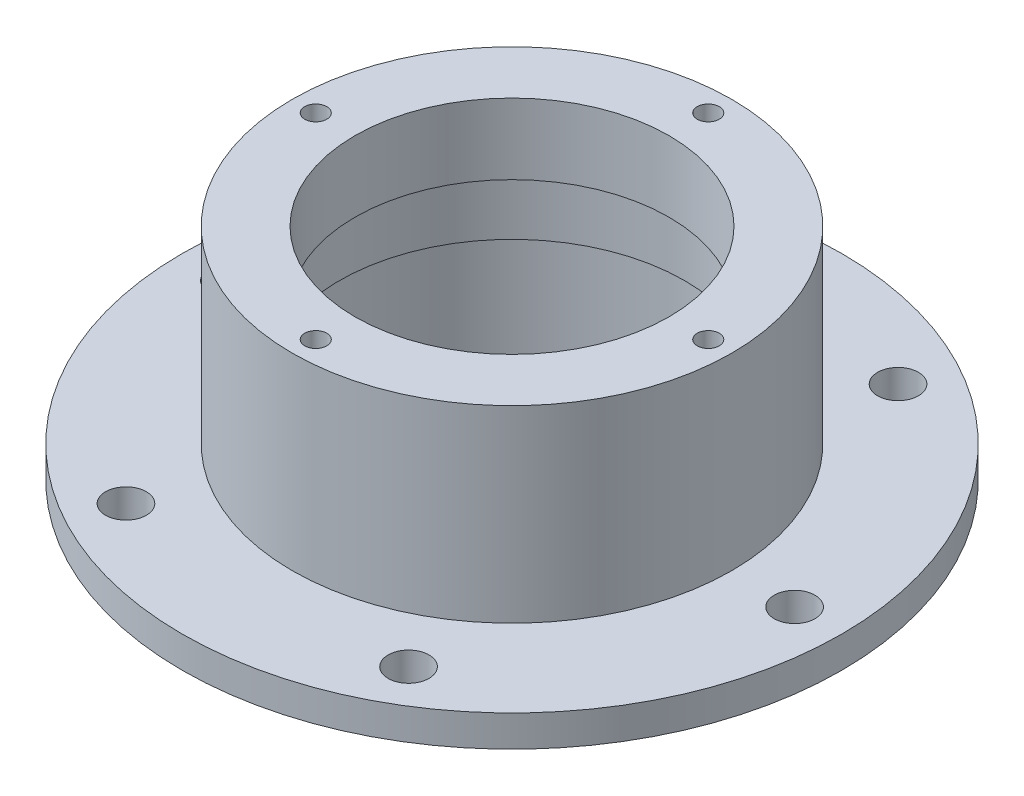
ISO-10303-21;
HEADER;
FILE_DESCRIPTION(('STEP AP214'),'2;1');
FILE_NAME('part.step','',(''),(''),'','','');
FILE_SCHEMA(('AUTOMOTIVE_DESIGN { 1 0 10303 214 1 1 1 1 }'));
ENDSEC;
DATA;
#1=APPLICATION_CONTEXT('core data for automotive mechanical design processes');
#2=APPLICATION_PROTOCOL_DEFINITION('international standard','automotive_design',2000,#1);
#3=PRODUCT_CONTEXT('',#1,'mechanical');
#4=PRODUCT('Part','Part','',(#3));
#5=PRODUCT_RELATED_PRODUCT_CATEGORY('part','',(#4));
#6=PRODUCT_DEFINITION_FORMATION('','',#4);
#7=PRODUCT_DEFINITION_CONTEXT('part definition',#1,'design');
#8=PRODUCT_DEFINITION('design','',#6,#7);
#9=PRODUCT_DEFINITION_SHAPE('','',#8);
#10=(LENGTH_UNIT() NAMED_UNIT(*) SI_UNIT(.MILLI.,.METRE.));
#11=(NAMED_UNIT(*) PLANE_ANGLE_UNIT() SI_UNIT($,.RADIAN.));
#12=(NAMED_UNIT(*) SI_UNIT($,.STERADIAN.) SOLID_ANGLE_UNIT());
#13=UNCERTAINTY_MEASURE_WITH_UNIT(LENGTH_MEASURE(1.E-05),#10,'distance_accuracy_value','');
#14=(GEOMETRIC_REPRESENTATION_CONTEXT(3) GLOBAL_UNCERTAINTY_ASSIGNED_CONTEXT((#13)) GLOBAL_UNIT_ASSIGNED_CONTEXT((#10,
#11,#12)) REPRESENTATION_CONTEXT('',''));
#15=CARTESIAN_POINT('',(0.,0.,0.));
#16=DIRECTION('',(0.,0.,1.));
#17=DIRECTION('',(1.,0.,0.));
#18=AXIS2_PLACEMENT_3D('',#15,#16,#17);
#19=CARTESIAN_POINT('',(0.,4.99999999999999,0.));
#20=DIRECTION('',(0.,-1.,0.));
#21=DIRECTION('',(0.,0.,-1.));
#22=AXIS2_PLACEMENT_3D('',#19,#20,#21);
#23=CYLINDRICAL_SURFACE('',#22,65.);
#24=DIRECTION('',(0.,1.,0.));
#25=VECTOR('',#24,1.);
#26=CARTESIAN_POINT('',(2.49753798769898,37.5,-64.9520000000001));
#27=LINE('',#26,#25);
#28=CARTESIAN_POINT('',(2.49753798769889,4.99999999999999,-64.952));
#29=VERTEX_POINT('',#28);
#30=CARTESIAN_POINT('',(2.49753798769889,0.,-64.952));
#31=VERTEX_POINT('',#30);
#32=EDGE_CURVE('E55',#29,#31,#27,.F.);
#33=ORIENTED_EDGE('',*,*,#32,.F.);
#34=CARTESIAN_POINT('',(0.,4.99999999999999,0.));
#35=DIRECTION('',(0.,-1.,0.));
#36=DIRECTION('',(0.,0.,-1.));
#37=AXIS2_PLACEMENT_3D('',#34,#35,#36);
#38=CIRCLE('',#37,65.);
#39=CARTESIAN_POINT('',(64.952,4.99999999999999,-2.49753798769897));
#40=VERTEX_POINT('',#39);
#41=EDGE_CURVE('E152',#29,#40,#38,.T.);
#42=ORIENTED_EDGE('',*,*,#41,.T.);
#43=DIRECTION('',(0.,1.,0.));
#44=VECTOR('',#43,1.);
#45=CARTESIAN_POINT('',(64.9520000000001,37.5,-2.49753798769897));
#46=LINE('',#45,#44);
#47=CARTESIAN_POINT('',(64.952,0.,-2.49753798769897));
#48=VERTEX_POINT('',#47);
#49=EDGE_CURVE('E330',#48,#40,#46,.T.);
#50=ORIENTED_EDGE('',*,*,#49,.F.);
#51=CARTESIAN_POINT('',(0.,0.,0.));
#52=DIRECTION('',(0.,-1.,0.));
#53=DIRECTION('',(0.,0.,-1.));
#54=AXIS2_PLACEMENT_3D('',#51,#52,#53);
#55=CIRCLE('',#54,65.);
#56=EDGE_CURVE('E62',#31,#48,#55,.T.);
#57=ORIENTED_EDGE('',*,*,#56,.F.);
#58=EDGE_LOOP('',(#33,#42,#50,#57));
#59=FACE_BOUND('',#58,.T.);
#60=ADVANCED_FACE('F39',(#59),#23,.T.);
#61=DIRECTION('',(0.,1.,0.));
#62=VECTOR('',#61,1.);
#63=CARTESIAN_POINT('',(64.9520000000001,37.5,2.49753798769897));
#64=LINE('',#63,#62);
#65=CARTESIAN_POINT('',(64.952,4.99999999999999,2.49753798769889));
#66=VERTEX_POINT('',#65);
#67=CARTESIAN_POINT('',(64.9520000000001,0.,2.49753798769897));
#68=VERTEX_POINT('',#67);
#69=EDGE_CURVE('E167',#66,#68,#64,.F.);
#70=ORIENTED_EDGE('',*,*,#69,.F.);
#71=CARTESIAN_POINT('',(2.49753798769896,4.99999999999999,64.952));
#72=VERTEX_POINT('',#71);
#73=EDGE_CURVE('E132',#66,#72,#38,.T.);
#74=ORIENTED_EDGE('',*,*,#73,.T.);
#75=DIRECTION('',(0.,1.,0.));
#76=VECTOR('',#75,1.);
#77=CARTESIAN_POINT('',(2.49753798769898,37.5,64.9520000000001));
#78=LINE('',#77,#76);
#79=CARTESIAN_POINT('',(2.49753798769896,0.,64.952));
#80=VERTEX_POINT('',#79);
#81=EDGE_CURVE('E166',#80,#72,#78,.T.);
#82=ORIENTED_EDGE('',*,*,#81,.F.);
#83=EDGE_CURVE('E134',#68,#80,#55,.T.);
#84=ORIENTED_EDGE('',*,*,#83,.F.);
#85=EDGE_LOOP('',(#70,#74,#82,#84));
#86=FACE_BOUND('',#85,.T.);
#87=ADVANCED_FACE('F164',(#86),#23,.T.);
#88=DIRECTION('',(0.,1.,0.));
#89=VECTOR('',#88,1.);
#90=CARTESIAN_POINT('',(-2.49753798769898,37.5,64.9520000000001));
#91=LINE('',#90,#89);
#92=CARTESIAN_POINT('',(-2.49753798769889,4.99999999999999,64.952));
#93=VERTEX_POINT('',#92);
#94=CARTESIAN_POINT('',(-2.49753798769897,0.,64.9520000000001));
#95=VERTEX_POINT('',#94);
#96=EDGE_CURVE('E185',#93,#95,#91,.F.);
#97=ORIENTED_EDGE('',*,*,#96,.F.);
#98=CARTESIAN_POINT('',(-64.952,4.99999999999999,2.49753798769899));
#99=VERTEX_POINT('',#98);
#100=EDGE_CURVE('E128',#93,#99,#38,.T.);
#101=ORIENTED_EDGE('',*,*,#100,.T.);
#102=DIRECTION('',(0.,1.,0.));
#103=VECTOR('',#102,1.);
#104=CARTESIAN_POINT('',(-64.9520000000001,37.5,2.49753798769898));
#105=LINE('',#104,#103);
#106=CARTESIAN_POINT('',(-64.9520000000001,0.,2.49753798769897));
#107=VERTEX_POINT('',#106);
#108=EDGE_CURVE('E197',#107,#99,#105,.T.);
#109=ORIENTED_EDGE('',*,*,#108,.F.);
#110=EDGE_CURVE('E129',#95,#107,#55,.T.);
#111=ORIENTED_EDGE('',*,*,#110,.F.);
#112=EDGE_LOOP('',(#97,#101,#109,#111));
#113=FACE_BOUND('',#112,.T.);
#114=ADVANCED_FACE('F304',(#113),#23,.T.);
#115=CARTESIAN_POINT('',(0.,75.,0.));
#116=DIRECTION('',(0.,-1.,0.));
#117=DIRECTION('',(0.,0.,-1.));
#118=AXIS2_PLACEMENT_3D('',#115,#116,#117);
#119=CYLINDRICAL_SURFACE('',#118,105.);
#120=CARTESIAN_POINT('',(0.,15.,0.));
#121=DIRECTION('',(0.,-1.,0.));
#122=DIRECTION('',(0.,0.,-1.));
#123=AXIS2_PLACEMENT_3D('',#120,#121,#122);
#124=CIRCLE('',#123,105.);
#125=CARTESIAN_POINT('',(0.,15.,-105.));
#126=VERTEX_POINT('',#125);
#127=EDGE_CURVE('E142',#126,#126,#124,.T.);
#128=ORIENTED_EDGE('',*,*,#127,.T.);
#129=EDGE_LOOP('',(#128));
#130=FACE_BOUND('',#129,.T.);
#131=CARTESIAN_POINT('',(0.,4.99999999999999,0.));
#132=DIRECTION('',(0.,-1.,0.));
#133=DIRECTION('',(0.,0.,-1.));
#134=AXIS2_PLACEMENT_3D('',#131,#132,#133);
#135=CIRCLE('',#134,105.);
#136=CARTESIAN_POINT('',(0.,4.99999999999999,-105.));
#137=VERTEX_POINT('',#136);
#138=EDGE_CURVE('E11',#137,#137,#135,.T.);
#139=ORIENTED_EDGE('',*,*,#138,.F.);
#140=EDGE_LOOP('',(#139));
#141=FACE_BOUND('',#140,.T.);
#142=ADVANCED_FACE('F41',(#130,#141),#119,.T.);
#143=CARTESIAN_POINT('',(0.,4.99999999999999,0.));
#144=DIRECTION('',(0.,-1.,0.));
#145=DIRECTION('',(0.,0.,-1.));
#146=AXIS2_PLACEMENT_3D('',#143,#144,#145);
#147=PLANE('',#146);
#148=CARTESIAN_POINT('',(0.,4.99999999999999,-62.5));
#149=DIRECTION('',(0.,-1.,0.));
#150=DIRECTION('',(0.,0.,-1.));
#151=AXIS2_PLACEMENT_3D('',#148,#149,#150);
#152=CIRCLE('',#151,3.49999999999999);
#153=CARTESIAN_POINT('',(-2.497537987699,4.99999999999999,-64.952));
#154=VERTEX_POINT('',#153);
#155=EDGE_CURVE('E121',#154,#29,#152,.T.);
#156=ORIENTED_EDGE('',*,*,#155,.F.);
#157=CARTESIAN_POINT('',(-64.952,4.99999999999999,-2.49753798769889));
#158=VERTEX_POINT('',#157);
#159=EDGE_CURVE('E48',#158,#154,#38,.T.);
#160=ORIENTED_EDGE('',*,*,#159,.F.);
#161=CARTESIAN_POINT('',(-62.5,4.99999999999999,0.));
#162=DIRECTION('',(0.,-1.,0.));
#163=DIRECTION('',(0.,0.,-1.));
#164=AXIS2_PLACEMENT_3D('',#161,#162,#163);
#165=CIRCLE('',#164,3.49999999999999);
#166=EDGE_CURVE('E201',#99,#158,#165,.T.);
#167=ORIENTED_EDGE('',*,*,#166,.F.);
#168=ORIENTED_EDGE('',*,*,#100,.F.);
#169=CARTESIAN_POINT('',(0.,4.99999999999999,62.5));
#170=DIRECTION('',(0.,-1.,0.));
#171=DIRECTION('',(0.,0.,-1.));
#172=AXIS2_PLACEMENT_3D('',#169,#170,#171);
#173=CIRCLE('',#172,3.49999999999999);
#174=EDGE_CURVE('E175',#72,#93,#173,.T.);
#175=ORIENTED_EDGE('',*,*,#174,.F.);
#176=ORIENTED_EDGE('',*,*,#73,.F.);
#177=CARTESIAN_POINT('',(62.5,4.99999999999999,0.));
#178=DIRECTION('',(0.,-1.,0.));
#179=DIRECTION('',(0.,0.,-1.));
#180=AXIS2_PLACEMENT_3D('',#177,#178,#179);
#181=CIRCLE('',#180,3.49999999999998);
#182=EDGE_CURVE('E327',#40,#66,#181,.T.);
#183=ORIENTED_EDGE('',*,*,#182,.F.);
#184=ORIENTED_EDGE('',*,*,#41,.F.);
#185=EDGE_LOOP('',(#156,#160,#167,#168,#175,#176,#183,#184));
#186=FACE_BOUND('',#185,.T.);
#187=CARTESIAN_POINT('',(90.,4.99999999999999,0.));
#188=DIRECTION('',(0.,-1.,0.));
#189=DIRECTION('',(0.,0.,-1.));
#190=AXIS2_PLACEMENT_3D('',#187,#188,#189);
#191=CIRCLE('',#190,6.49999999999999);
#192=CARTESIAN_POINT('',(90.,4.99999999999999,-6.49999999999999));
#193=VERTEX_POINT('',#192);
#194=EDGE_CURVE('E211',#193,#193,#191,.T.);
#195=ORIENTED_EDGE('',*,*,#194,.F.);
#196=EDGE_LOOP('',(#195));
#197=FACE_BOUND('',#196,.T.);
#198=CARTESIAN_POINT('',(44.9999999999998,4.99999999999999,77.9422863405996));
#199=DIRECTION('',(0.,-1.,0.));
#200=DIRECTION('',(0.,0.,-1.));
#201=AXIS2_PLACEMENT_3D('',#198,#199,#200);
#202=CIRCLE('',#201,6.5);
#203=CARTESIAN_POINT('',(44.9999999999998,4.99999999999999,71.4422863405996));
#204=VERTEX_POINT('',#203);
#205=EDGE_CURVE('E219',#204,#204,#202,.T.);
#206=ORIENTED_EDGE('',*,*,#205,.F.);
#207=EDGE_LOOP('',(#206));
#208=FACE_BOUND('',#207,.T.);
#209=CARTESIAN_POINT('',(-45.0000000000004,4.99999999999999,77.9422863405993));
#210=DIRECTION('',(0.,-1.,0.));
#211=DIRECTION('',(0.,0.,-1.));
#212=AXIS2_PLACEMENT_3D('',#209,#210,#211);
#213=CIRCLE('',#212,6.5);
#214=CARTESIAN_POINT('',(-45.0000000000004,4.99999999999999,71.4422863405993));
#215=VERTEX_POINT('',#214);
#216=EDGE_CURVE('E227',#215,#215,#213,.T.);
#217=ORIENTED_EDGE('',*,*,#216,.F.);
#218=EDGE_LOOP('',(#217));
#219=FACE_BOUND('',#218,.T.);
#220=CARTESIAN_POINT('',(-90.,4.99999999999999,-6.28466640991764E-13));
#221=DIRECTION('',(0.,-1.,0.));
#222=DIRECTION('',(0.,0.,-1.));
#223=AXIS2_PLACEMENT_3D('',#220,#221,#222);
#224=CIRCLE('',#223,6.49999999999999);
#225=CARTESIAN_POINT('',(-90.,4.99999999999999,-6.50000000000062));
#226=VERTEX_POINT('',#225);
#227=EDGE_CURVE('E235',#226,#226,#224,.T.);
#228=ORIENTED_EDGE('',*,*,#227,.F.);
#229=EDGE_LOOP('',(#228));
#230=FACE_BOUND('',#229,.T.);
#231=CARTESIAN_POINT('',(-44.9999999999993,4.99999999999999,-77.9422863405999));
#232=DIRECTION('',(0.,-1.,0.));
#233=DIRECTION('',(0.,0.,-1.));
#234=AXIS2_PLACEMENT_3D('',#231,#232,#233);
#235=CIRCLE('',#234,6.5);
#236=CARTESIAN_POINT('',(-44.9999999999993,4.99999999999999,-84.4422863405999));
#237=VERTEX_POINT('',#236);
#238=EDGE_CURVE('E243',#237,#237,#235,.T.);
#239=ORIENTED_EDGE('',*,*,#238,.F.);
#240=EDGE_LOOP('',(#239));
#241=FACE_BOUND('',#240,.T.);
#242=CARTESIAN_POINT('',(45.0000000000009,4.99999999999999,-77.942286340599));
#243=DIRECTION('',(0.,-1.,0.));
#244=DIRECTION('',(0.,0.,-1.));
#245=AXIS2_PLACEMENT_3D('',#242,#243,#244);
#246=CIRCLE('',#245,6.5);
#247=CARTESIAN_POINT('',(45.0000000000009,4.99999999999999,-84.442286340599));
#248=VERTEX_POINT('',#247);
#249=EDGE_CURVE('E251',#248,#248,#246,.T.);
#250=ORIENTED_EDGE('',*,*,#249,.F.);
#251=EDGE_LOOP('',(#250));
#252=FACE_BOUND('',#251,.T.);
#253=ORIENTED_EDGE('',*,*,#138,.T.);
#254=EDGE_LOOP('',(#253));
#255=FACE_BOUND('',#254,.T.);
#256=ADVANCED_FACE('F181',(#186,#197,#208,#219,#230,#241,#252,#255),#147,.T.);
#257=DIRECTION('',(0.,1.,0.));
#258=VECTOR('',#257,1.);
#259=CARTESIAN_POINT('',(-2.49753798769898,37.5,-64.9520000000001));
#260=LINE('',#259,#258);
#261=CARTESIAN_POINT('',(-2.49753798769897,0.,-64.9520000000001));
#262=VERTEX_POINT('',#261);
#263=EDGE_CURVE('E107',#262,#154,#260,.T.);
#264=ORIENTED_EDGE('',*,*,#263,.F.);
#265=CARTESIAN_POINT('',(-64.952,0.,-2.49753798769889));
#266=VERTEX_POINT('',#265);
#267=EDGE_CURVE('E118',#266,#262,#55,.T.);
#268=ORIENTED_EDGE('',*,*,#267,.F.);
#269=DIRECTION('',(0.,1.,0.));
#270=VECTOR('',#269,1.);
#271=CARTESIAN_POINT('',(-64.9520000000001,37.5,-2.49753798769898));
#272=LINE('',#271,#270);
#273=EDGE_CURVE('E204',#158,#266,#272,.F.);
#274=ORIENTED_EDGE('',*,*,#273,.F.);
#275=ORIENTED_EDGE('',*,*,#159,.T.);
#276=EDGE_LOOP('',(#264,#268,#274,#275));
#277=FACE_BOUND('',#276,.T.);
#278=ADVANCED_FACE('F116',(#277),#23,.T.);
#279=CARTESIAN_POINT('',(0.,0.,0.));
#280=DIRECTION('',(0.,1.,0.));
#281=DIRECTION('',(0.,0.,1.));
#282=AXIS2_PLACEMENT_3D('',#279,#280,#281);
#283=PLANE('',#282);
#284=CARTESIAN_POINT('',(0.,0.,0.));
#285=DIRECTION('',(0.,-1.,0.));
#286=DIRECTION('',(0.,0.,-1.));
#287=AXIS2_PLACEMENT_3D('',#284,#285,#286);
#288=CIRCLE('',#287,55.4);
#289=CARTESIAN_POINT('',(0.,0.,-55.4));
#290=VERTEX_POINT('',#289);
#291=EDGE_CURVE('E268',#290,#290,#288,.T.);
#292=ORIENTED_EDGE('',*,*,#291,.F.);
#293=EDGE_LOOP('',(#292));
#294=FACE_BOUND('',#293,.T.);
#295=ORIENTED_EDGE('',*,*,#267,.T.);
#296=CARTESIAN_POINT('',(0.,0.,-62.5));
#297=DIRECTION('',(0.,1.,0.));
#298=DIRECTION('',(0.,0.,1.));
#299=AXIS2_PLACEMENT_3D('',#296,#297,#298);
#300=CIRCLE('',#299,3.49999999999998);
#301=EDGE_CURVE('E103',#262,#31,#300,.T.);
#302=ORIENTED_EDGE('',*,*,#301,.T.);
#303=ORIENTED_EDGE('',*,*,#56,.T.);
#304=CARTESIAN_POINT('',(62.5,0.,0.));
#305=DIRECTION('',(0.,1.,0.));
#306=DIRECTION('',(0.,0.,1.));
#307=AXIS2_PLACEMENT_3D('',#304,#305,#306);
#308=CIRCLE('',#307,3.49999999999998);
#309=EDGE_CURVE('E333',#48,#68,#308,.T.);
#310=ORIENTED_EDGE('',*,*,#309,.T.);
#311=ORIENTED_EDGE('',*,*,#83,.T.);
#312=CARTESIAN_POINT('',(0.,0.,62.5));
#313=DIRECTION('',(0.,1.,0.));
#314=DIRECTION('',(0.,0.,1.));
#315=AXIS2_PLACEMENT_3D('',#312,#313,#314);
#316=CIRCLE('',#315,3.49999999999998);
#317=EDGE_CURVE('E177',#80,#95,#316,.T.);
#318=ORIENTED_EDGE('',*,*,#317,.T.);
#319=ORIENTED_EDGE('',*,*,#110,.T.);
#320=CARTESIAN_POINT('',(-62.5,0.,0.));
#321=DIRECTION('',(0.,1.,0.));
#322=DIRECTION('',(0.,0.,1.));
#323=AXIS2_PLACEMENT_3D('',#320,#321,#322);
#324=CIRCLE('',#323,3.49999999999998);
#325=EDGE_CURVE('E126',#107,#266,#324,.T.);
#326=ORIENTED_EDGE('',*,*,#325,.T.);
#327=EDGE_LOOP('',(#295,#302,#303,#310,#311,#318,#319,#326));
#328=FACE_BOUND('',#327,.T.);
#329=ADVANCED_FACE('F124',(#294,#328),#283,.F.);
#330=CARTESIAN_POINT('',(0.,15.,0.));
#331=DIRECTION('',(0.,-1.,0.));
#332=DIRECTION('',(0.,0.,-1.));
#333=AXIS2_PLACEMENT_3D('',#330,#331,#332);
#334=PLANE('',#333);
#335=CARTESIAN_POINT('',(90.,15.,0.));
#336=DIRECTION('',(0.,1.,0.));
#337=DIRECTION('',(0.,0.,1.));
#338=AXIS2_PLACEMENT_3D('',#335,#336,#337);
#339=CIRCLE('',#338,6.49999999999999);
#340=CARTESIAN_POINT('',(90.,15.,6.49999999999999));
#341=VERTEX_POINT('',#340);
#342=EDGE_CURVE('E207',#341,#341,#339,.T.);
#343=ORIENTED_EDGE('',*,*,#342,.F.);
#344=EDGE_LOOP('',(#343));
#345=FACE_BOUND('',#344,.T.);
#346=CARTESIAN_POINT('',(44.9999999999998,15.,77.9422863405996));
#347=DIRECTION('',(0.,1.,0.));
#348=DIRECTION('',(0.,0.,1.));
#349=AXIS2_PLACEMENT_3D('',#346,#347,#348);
#350=CIRCLE('',#349,6.5);
#351=CARTESIAN_POINT('',(44.9999999999998,15.,84.4422863405996));
#352=VERTEX_POINT('',#351);
#353=EDGE_CURVE('E215',#352,#352,#350,.T.);
#354=ORIENTED_EDGE('',*,*,#353,.F.);
#355=EDGE_LOOP('',(#354));
#356=FACE_BOUND('',#355,.T.);
#357=CARTESIAN_POINT('',(-45.0000000000004,15.,77.9422863405993));
#358=DIRECTION('',(0.,1.,0.));
#359=DIRECTION('',(0.,0.,1.));
#360=AXIS2_PLACEMENT_3D('',#357,#358,#359);
#361=CIRCLE('',#360,6.5);
#362=CARTESIAN_POINT('',(-45.0000000000004,15.,84.4422863405993));
#363=VERTEX_POINT('',#362);
#364=EDGE_CURVE('E223',#363,#363,#361,.T.);
#365=ORIENTED_EDGE('',*,*,#364,.F.);
#366=EDGE_LOOP('',(#365));
#367=FACE_BOUND('',#366,.T.);
#368=CARTESIAN_POINT('',(-90.,15.,-6.28466640991764E-13));
#369=DIRECTION('',(0.,1.,0.));
#370=DIRECTION('',(0.,0.,1.));
#371=AXIS2_PLACEMENT_3D('',#368,#369,#370);
#372=CIRCLE('',#371,6.49999999999999);
#373=CARTESIAN_POINT('',(-90.,15.,6.49999999999936));
#374=VERTEX_POINT('',#373);
#375=EDGE_CURVE('E231',#374,#374,#372,.T.);
#376=ORIENTED_EDGE('',*,*,#375,.F.);
#377=EDGE_LOOP('',(#376));
#378=FACE_BOUND('',#377,.T.);
#379=CARTESIAN_POINT('',(-44.9999999999993,15.,-77.9422863405999));
#380=DIRECTION('',(0.,1.,0.));
#381=DIRECTION('',(0.,0.,1.));
#382=AXIS2_PLACEMENT_3D('',#379,#380,#381);
#383=CIRCLE('',#382,6.5);
#384=CARTESIAN_POINT('',(-44.9999999999993,15.,-71.4422863405999));
#385=VERTEX_POINT('',#384);
#386=EDGE_CURVE('E239',#385,#385,#383,.T.);
#387=ORIENTED_EDGE('',*,*,#386,.F.);
#388=EDGE_LOOP('',(#387));
#389=FACE_BOUND('',#388,.T.);
#390=CARTESIAN_POINT('',(45.0000000000009,15.,-77.942286340599));
#391=DIRECTION('',(0.,1.,0.));
#392=DIRECTION('',(0.,0.,1.));
#393=AXIS2_PLACEMENT_3D('',#390,#391,#392);
#394=CIRCLE('',#393,6.5);
#395=CARTESIAN_POINT('',(45.0000000000009,15.,-71.442286340599));
#396=VERTEX_POINT('',#395);
#397=EDGE_CURVE('E247',#396,#396,#394,.T.);
#398=ORIENTED_EDGE('',*,*,#397,.F.);
#399=EDGE_LOOP('',(#398));
#400=FACE_BOUND('',#399,.T.);
#401=CARTESIAN_POINT('',(0.,15.,0.));
#402=DIRECTION('',(0.,-1.,0.));
#403=DIRECTION('',(0.,0.,-1.));
#404=AXIS2_PLACEMENT_3D('',#401,#402,#403);
#405=CIRCLE('',#404,70.);
#406=CARTESIAN_POINT('',(0.,15.,-70.));
#407=VERTEX_POINT('',#406);
#408=EDGE_CURVE('E148',#407,#407,#405,.T.);
#409=ORIENTED_EDGE('',*,*,#408,.T.);
#410=EDGE_LOOP('',(#409));
#411=FACE_BOUND('',#410,.T.);
#412=ORIENTED_EDGE('',*,*,#127,.F.);
#413=EDGE_LOOP('',(#412));
#414=FACE_BOUND('',#413,.T.);
#415=ADVANCED_FACE('F282',(#345,#356,#367,#378,#389,#400,#411,#414),#334,.F.);
#416=CARTESIAN_POINT('',(0.,75.001,0.));
#417=DIRECTION('',(0.,-1.,0.));
#418=DIRECTION('',(0.,0.,-1.));
#419=AXIS2_PLACEMENT_3D('',#416,#417,#418);
#420=CYLINDRICAL_SURFACE('',#419,70.);
#421=CARTESIAN_POINT('',(0.,75.,0.));
#422=DIRECTION('',(0.,1.,0.));
#423=DIRECTION('',(0.,0.,1.));
#424=AXIS2_PLACEMENT_3D('',#421,#422,#423);
#425=CIRCLE('',#424,70.);
#426=CARTESIAN_POINT('',(0.,75.,70.));
#427=VERTEX_POINT('',#426);
#428=EDGE_CURVE('E136',#427,#427,#425,.F.);
#429=ORIENTED_EDGE('',*,*,#428,.T.);
#430=EDGE_LOOP('',(#429));
#431=FACE_BOUND('',#430,.T.);
#432=ORIENTED_EDGE('',*,*,#408,.F.);
#433=EDGE_LOOP('',(#432));
#434=FACE_BOUND('',#433,.T.);
#435=ADVANCED_FACE('F285',(#431,#434),#420,.T.);
#436=CARTESIAN_POINT('',(0.,75.,0.));
#437=DIRECTION('',(0.,1.,0.));
#438=DIRECTION('',(0.,0.,1.));
#439=AXIS2_PLACEMENT_3D('',#436,#437,#438);
#440=PLANE('',#439);
#441=CARTESIAN_POINT('',(0.,75.,-62.5));
#442=DIRECTION('',(0.,1.,0.));
#443=DIRECTION('',(0.,0.,1.));
#444=AXIS2_PLACEMENT_3D('',#441,#442,#443);
#445=CIRCLE('',#444,3.49999999999999);
#446=CARTESIAN_POINT('',(0.,75.,-59.));
#447=VERTEX_POINT('',#446);
#448=EDGE_CURVE('E111',#447,#447,#445,.T.);
#449=ORIENTED_EDGE('',*,*,#448,.F.);
#450=EDGE_LOOP('',(#449));
#451=FACE_BOUND('',#450,.T.);
#452=CARTESIAN_POINT('',(62.5,75.,0.));
#453=DIRECTION('',(0.,1.,0.));
#454=DIRECTION('',(0.,0.,1.));
#455=AXIS2_PLACEMENT_3D('',#452,#453,#454);
#456=CIRCLE('',#455,3.49999999999999);
#457=CARTESIAN_POINT('',(62.5,75.,3.49999999999999));
#458=VERTEX_POINT('',#457);
#459=EDGE_CURVE('E336',#458,#458,#456,.T.);
#460=ORIENTED_EDGE('',*,*,#459,.F.);
#461=EDGE_LOOP('',(#460));
#462=FACE_BOUND('',#461,.T.);
#463=CARTESIAN_POINT('',(0.,75.,62.5));
#464=DIRECTION('',(0.,1.,0.));
#465=DIRECTION('',(0.,0.,1.));
#466=AXIS2_PLACEMENT_3D('',#463,#464,#465);
#467=CIRCLE('',#466,3.49999999999999);
#468=CARTESIAN_POINT('',(0.,75.,66.));
#469=VERTEX_POINT('',#468);
#470=EDGE_CURVE('E320',#469,#469,#467,.T.);
#471=ORIENTED_EDGE('',*,*,#470,.F.);
#472=EDGE_LOOP('',(#471));
#473=FACE_BOUND('',#472,.T.);
#474=CARTESIAN_POINT('',(-62.5,75.,0.));
#475=DIRECTION('',(0.,1.,0.));
#476=DIRECTION('',(0.,0.,1.));
#477=AXIS2_PLACEMENT_3D('',#474,#475,#476);
#478=CIRCLE('',#477,3.49999999999999);
#479=CARTESIAN_POINT('',(-62.5,75.,3.49999999999999));
#480=VERTEX_POINT('',#479);
#481=EDGE_CURVE('E188',#480,#480,#478,.T.);
#482=ORIENTED_EDGE('',*,*,#481,.F.);
#483=EDGE_LOOP('',(#482));
#484=FACE_BOUND('',#483,.T.);
#485=CARTESIAN_POINT('',(0.,75.,0.));
#486=DIRECTION('',(0.,1.,0.));
#487=DIRECTION('',(0.,0.,1.));
#488=AXIS2_PLACEMENT_3D('',#485,#486,#487);
#489=CIRCLE('',#488,50.);
#490=CARTESIAN_POINT('',(0.,75.,50.));
#491=VERTEX_POINT('',#490);
#492=EDGE_CURVE('E255',#491,#491,#489,.F.);
#493=ORIENTED_EDGE('',*,*,#492,.T.);
#494=EDGE_LOOP('',(#493));
#495=FACE_BOUND('',#494,.T.);
#496=ORIENTED_EDGE('',*,*,#428,.F.);
#497=EDGE_LOOP('',(#496));
#498=FACE_BOUND('',#497,.T.);
#499=ADVANCED_FACE('F287',(#451,#462,#473,#484,#495,#498),#440,.T.);
#500=CARTESIAN_POINT('',(0.,32.5,0.));
#501=DIRECTION('',(0.,-1.,0.));
#502=DIRECTION('',(0.,0.,-1.));
#503=AXIS2_PLACEMENT_3D('',#500,#501,#502);
#504=CYLINDRICAL_SURFACE('',#503,55.4);
#505=CARTESIAN_POINT('',(0.,32.5,0.));
#506=DIRECTION('',(0.,-1.,0.));
#507=DIRECTION('',(0.,0.,-1.));
#508=AXIS2_PLACEMENT_3D('',#505,#506,#507);
#509=CIRCLE('',#508,55.4);
#510=CARTESIAN_POINT('',(0.,32.5,-55.4));
#511=VERTEX_POINT('',#510);
#512=EDGE_CURVE('E272',#511,#511,#509,.T.);
#513=ORIENTED_EDGE('',*,*,#512,.F.);
#514=EDGE_LOOP('',(#513));
#515=FACE_BOUND('',#514,.T.);
#516=ORIENTED_EDGE('',*,*,#291,.T.);
#517=EDGE_LOOP('',(#516));
#518=FACE_BOUND('',#517,.T.);
#519=ADVANCED_FACE('F293',(#515,#518),#504,.F.);
#520=CARTESIAN_POINT('',(0.,32.5,0.));
#521=DIRECTION('',(0.,-1.,0.));
#522=DIRECTION('',(0.,0.,-1.));
#523=AXIS2_PLACEMENT_3D('',#520,#521,#522);
#524=PLANE('',#523);
#525=CARTESIAN_POINT('',(0.,32.5,0.));
#526=DIRECTION('',(0.,-1.,0.));
#527=DIRECTION('',(0.,0.,-1.));
#528=AXIS2_PLACEMENT_3D('',#525,#526,#527);
#529=CIRCLE('',#528,55.);
#530=CARTESIAN_POINT('',(0.,32.5,-55.));
#531=VERTEX_POINT('',#530);
#532=EDGE_CURVE('E260',#531,#531,#529,.T.);
#533=ORIENTED_EDGE('',*,*,#532,.F.);
#534=EDGE_LOOP('',(#533));
#535=FACE_BOUND('',#534,.T.);
#536=ORIENTED_EDGE('',*,*,#512,.T.);
#537=EDGE_LOOP('',(#536));
#538=FACE_BOUND('',#537,.T.);
#539=ADVANCED_FACE('F373',(#535,#538),#524,.T.);
#540=CARTESIAN_POINT('',(0.,52.5,0.));
#541=DIRECTION('',(0.,-1.,0.));
#542=DIRECTION('',(0.,0.,-1.));
#543=AXIS2_PLACEMENT_3D('',#540,#541,#542);
#544=CYLINDRICAL_SURFACE('',#543,55.);
#545=CARTESIAN_POINT('',(0.,52.5,0.));
#546=DIRECTION('',(0.,-1.,0.));
#547=DIRECTION('',(0.,0.,-1.));
#548=AXIS2_PLACEMENT_3D('',#545,#546,#547);
#549=CIRCLE('',#548,55.);
#550=CARTESIAN_POINT('',(0.,52.5,-55.));
#551=VERTEX_POINT('',#550);
#552=EDGE_CURVE('E264',#551,#551,#549,.T.);
#553=ORIENTED_EDGE('',*,*,#552,.F.);
#554=EDGE_LOOP('',(#553));
#555=FACE_BOUND('',#554,.T.);
#556=ORIENTED_EDGE('',*,*,#532,.T.);
#557=EDGE_LOOP('',(#556));
#558=FACE_BOUND('',#557,.T.);
#559=ADVANCED_FACE('F367',(#555,#558),#544,.F.);
#560=CARTESIAN_POINT('',(0.,52.5,0.));
#561=DIRECTION('',(0.,-1.,0.));
#562=DIRECTION('',(0.,0.,-1.));
#563=AXIS2_PLACEMENT_3D('',#560,#561,#562);
#564=PLANE('',#563);
#565=CARTESIAN_POINT('',(0.,52.5,0.));
#566=DIRECTION('',(0.,-1.,0.));
#567=DIRECTION('',(0.,0.,-1.));
#568=AXIS2_PLACEMENT_3D('',#565,#566,#567);
#569=CIRCLE('',#568,50.);
#570=CARTESIAN_POINT('',(0.,52.5,-50.));
#571=VERTEX_POINT('',#570);
#572=EDGE_CURVE('E256',#571,#571,#569,.T.);
#573=ORIENTED_EDGE('',*,*,#572,.F.);
#574=EDGE_LOOP('',(#573));
#575=FACE_BOUND('',#574,.T.);
#576=ORIENTED_EDGE('',*,*,#552,.T.);
#577=EDGE_LOOP('',(#576));
#578=FACE_BOUND('',#577,.T.);
#579=ADVANCED_FACE('F361',(#575,#578),#564,.T.);
#580=CARTESIAN_POINT('',(0.,75.001,0.));
#581=DIRECTION('',(0.,-1.,0.));
#582=DIRECTION('',(0.,0.,-1.));
#583=AXIS2_PLACEMENT_3D('',#580,#581,#582);
#584=CYLINDRICAL_SURFACE('',#583,50.);
#585=ORIENTED_EDGE('',*,*,#492,.F.);
#586=EDGE_LOOP('',(#585));
#587=FACE_BOUND('',#586,.T.);
#588=ORIENTED_EDGE('',*,*,#572,.T.);
#589=EDGE_LOOP('',(#588));
#590=FACE_BOUND('',#589,.T.);
#591=ADVANCED_FACE('F357',(#587,#590),#584,.F.);
#592=CARTESIAN_POINT('',(45.0000000000009,15.,-77.942286340599));
#593=DIRECTION('',(0.,1.,0.));
#594=DIRECTION('',(0.,0.,1.));
#595=AXIS2_PLACEMENT_3D('',#592,#593,#594);
#596=CYLINDRICAL_SURFACE('',#595,6.5);
#597=ORIENTED_EDGE('',*,*,#249,.T.);
#598=EDGE_LOOP('',(#597));
#599=FACE_BOUND('',#598,.T.);
#600=ORIENTED_EDGE('',*,*,#397,.T.);
#601=EDGE_LOOP('',(#600));
#602=FACE_BOUND('',#601,.T.);
#603=ADVANCED_FACE('F360',(#599,#602),#596,.F.);
#604=CARTESIAN_POINT('',(-44.9999999999993,15.,-77.9422863405999));
#605=DIRECTION('',(0.,1.,0.));
#606=DIRECTION('',(0.,0.,1.));
#607=AXIS2_PLACEMENT_3D('',#604,#605,#606);
#608=CYLINDRICAL_SURFACE('',#607,6.5);
#609=ORIENTED_EDGE('',*,*,#238,.T.);
#610=EDGE_LOOP('',(#609));
#611=FACE_BOUND('',#610,.T.);
#612=ORIENTED_EDGE('',*,*,#386,.T.);
#613=EDGE_LOOP('',(#612));
#614=FACE_BOUND('',#613,.T.);
#615=ADVANCED_FACE('F390',(#611,#614),#608,.F.);
#616=CARTESIAN_POINT('',(-90.,15.,-6.28466640991764E-13));
#617=DIRECTION('',(0.,1.,0.));
#618=DIRECTION('',(0.,0.,1.));
#619=AXIS2_PLACEMENT_3D('',#616,#617,#618);
#620=CYLINDRICAL_SURFACE('',#619,6.49999999999999);
#621=ORIENTED_EDGE('',*,*,#227,.T.);
#622=EDGE_LOOP('',(#621));
#623=FACE_BOUND('',#622,.T.);
#624=ORIENTED_EDGE('',*,*,#375,.T.);
#625=EDGE_LOOP('',(#624));
#626=FACE_BOUND('',#625,.T.);
#627=ADVANCED_FACE('F394',(#623,#626),#620,.F.);
#628=CARTESIAN_POINT('',(-45.0000000000004,15.,77.9422863405993));
#629=DIRECTION('',(0.,1.,0.));
#630=DIRECTION('',(0.,0.,1.));
#631=AXIS2_PLACEMENT_3D('',#628,#629,#630);
#632=CYLINDRICAL_SURFACE('',#631,6.5);
#633=ORIENTED_EDGE('',*,*,#216,.T.);
#634=EDGE_LOOP('',(#633));
#635=FACE_BOUND('',#634,.T.);
#636=ORIENTED_EDGE('',*,*,#364,.T.);
#637=EDGE_LOOP('',(#636));
#638=FACE_BOUND('',#637,.T.);
#639=ADVANCED_FACE('F398',(#635,#638),#632,.F.);
#640=CARTESIAN_POINT('',(44.9999999999998,15.,77.9422863405996));
#641=DIRECTION('',(0.,1.,0.));
#642=DIRECTION('',(0.,0.,1.));
#643=AXIS2_PLACEMENT_3D('',#640,#641,#642);
#644=CYLINDRICAL_SURFACE('',#643,6.5);
#645=ORIENTED_EDGE('',*,*,#205,.T.);
#646=EDGE_LOOP('',(#645));
#647=FACE_BOUND('',#646,.T.);
#648=ORIENTED_EDGE('',*,*,#353,.T.);
#649=EDGE_LOOP('',(#648));
#650=FACE_BOUND('',#649,.T.);
#651=ADVANCED_FACE('F402',(#647,#650),#644,.F.);
#652=CARTESIAN_POINT('',(90.,15.,0.));
#653=DIRECTION('',(0.,1.,0.));
#654=DIRECTION('',(0.,0.,1.));
#655=AXIS2_PLACEMENT_3D('',#652,#653,#654);
#656=CYLINDRICAL_SURFACE('',#655,6.49999999999999);
#657=ORIENTED_EDGE('',*,*,#194,.T.);
#658=EDGE_LOOP('',(#657));
#659=FACE_BOUND('',#658,.T.);
#660=ORIENTED_EDGE('',*,*,#342,.T.);
#661=EDGE_LOOP('',(#660));
#662=FACE_BOUND('',#661,.T.);
#663=ADVANCED_FACE('F406',(#659,#662),#656,.F.);
#664=CARTESIAN_POINT('',(-62.5,75.,0.));
#665=DIRECTION('',(0.,1.,0.));
#666=DIRECTION('',(0.,0.,1.));
#667=AXIS2_PLACEMENT_3D('',#664,#665,#666);
#668=CYLINDRICAL_SURFACE('',#667,3.49999999999999);
#669=ORIENTED_EDGE('',*,*,#273,.T.);
#670=ORIENTED_EDGE('',*,*,#325,.F.);
#671=ORIENTED_EDGE('',*,*,#108,.T.);
#672=ORIENTED_EDGE('',*,*,#166,.T.);
#673=EDGE_LOOP('',(#669,#670,#671,#672));
#674=FACE_BOUND('',#673,.T.);
#675=ORIENTED_EDGE('',*,*,#481,.T.);
#676=EDGE_LOOP('',(#675));
#677=FACE_BOUND('',#676,.T.);
#678=ADVANCED_FACE('F410',(#674,#677),#668,.F.);
#679=CARTESIAN_POINT('',(0.,75.,62.5));
#680=DIRECTION('',(0.,1.,0.));
#681=DIRECTION('',(0.,0.,1.));
#682=AXIS2_PLACEMENT_3D('',#679,#680,#681);
#683=CYLINDRICAL_SURFACE('',#682,3.49999999999999);
#684=ORIENTED_EDGE('',*,*,#96,.T.);
#685=ORIENTED_EDGE('',*,*,#317,.F.);
#686=ORIENTED_EDGE('',*,*,#81,.T.);
#687=ORIENTED_EDGE('',*,*,#174,.T.);
#688=EDGE_LOOP('',(#684,#685,#686,#687));
#689=FACE_BOUND('',#688,.T.);
#690=ORIENTED_EDGE('',*,*,#470,.T.);
#691=EDGE_LOOP('',(#690));
#692=FACE_BOUND('',#691,.T.);
#693=ADVANCED_FACE('F173',(#689,#692),#683,.F.);
#694=CARTESIAN_POINT('',(62.5,75.,0.));
#695=DIRECTION('',(0.,1.,0.));
#696=DIRECTION('',(0.,0.,1.));
#697=AXIS2_PLACEMENT_3D('',#694,#695,#696);
#698=CYLINDRICAL_SURFACE('',#697,3.49999999999998);
#699=ORIENTED_EDGE('',*,*,#69,.T.);
#700=ORIENTED_EDGE('',*,*,#309,.F.);
#701=ORIENTED_EDGE('',*,*,#49,.T.);
#702=ORIENTED_EDGE('',*,*,#182,.T.);
#703=EDGE_LOOP('',(#699,#700,#701,#702));
#704=FACE_BOUND('',#703,.T.);
#705=ORIENTED_EDGE('',*,*,#459,.T.);
#706=EDGE_LOOP('',(#705));
#707=FACE_BOUND('',#706,.T.);
#708=ADVANCED_FACE('F417',(#704,#707),#698,.F.);
#709=CARTESIAN_POINT('',(0.,75.,-62.5));
#710=DIRECTION('',(0.,1.,0.));
#711=DIRECTION('',(0.,0.,1.));
#712=AXIS2_PLACEMENT_3D('',#709,#710,#711);
#713=CYLINDRICAL_SURFACE('',#712,3.49999999999999);
#714=ORIENTED_EDGE('',*,*,#32,.T.);
#715=ORIENTED_EDGE('',*,*,#301,.F.);
#716=ORIENTED_EDGE('',*,*,#263,.T.);
#717=ORIENTED_EDGE('',*,*,#155,.T.);
#718=EDGE_LOOP('',(#714,#715,#716,#717));
#719=FACE_BOUND('',#718,.T.);
#720=ORIENTED_EDGE('',*,*,#448,.T.);
#721=EDGE_LOOP('',(#720));
#722=FACE_BOUND('',#721,.T.);
#723=ADVANCED_FACE('F105',(#719,#722),#713,.F.);
#724=CLOSED_SHELL('',(#60,#87,#114,#142,#256,#278,#329,#415,#435,#499,#519,#539,#559,#579,#591,
#603,#615,#627,#639,#651,#663,#678,#693,#708,#723));
#725=MANIFOLD_SOLID_BREP('B2',#724);
#726=ADVANCED_BREP_SHAPE_REPRESENTATION('',(#18,#725),#14);
#727=SHAPE_DEFINITION_REPRESENTATION(#9,#726);
ENDSEC;
END-ISO-10303-21;
